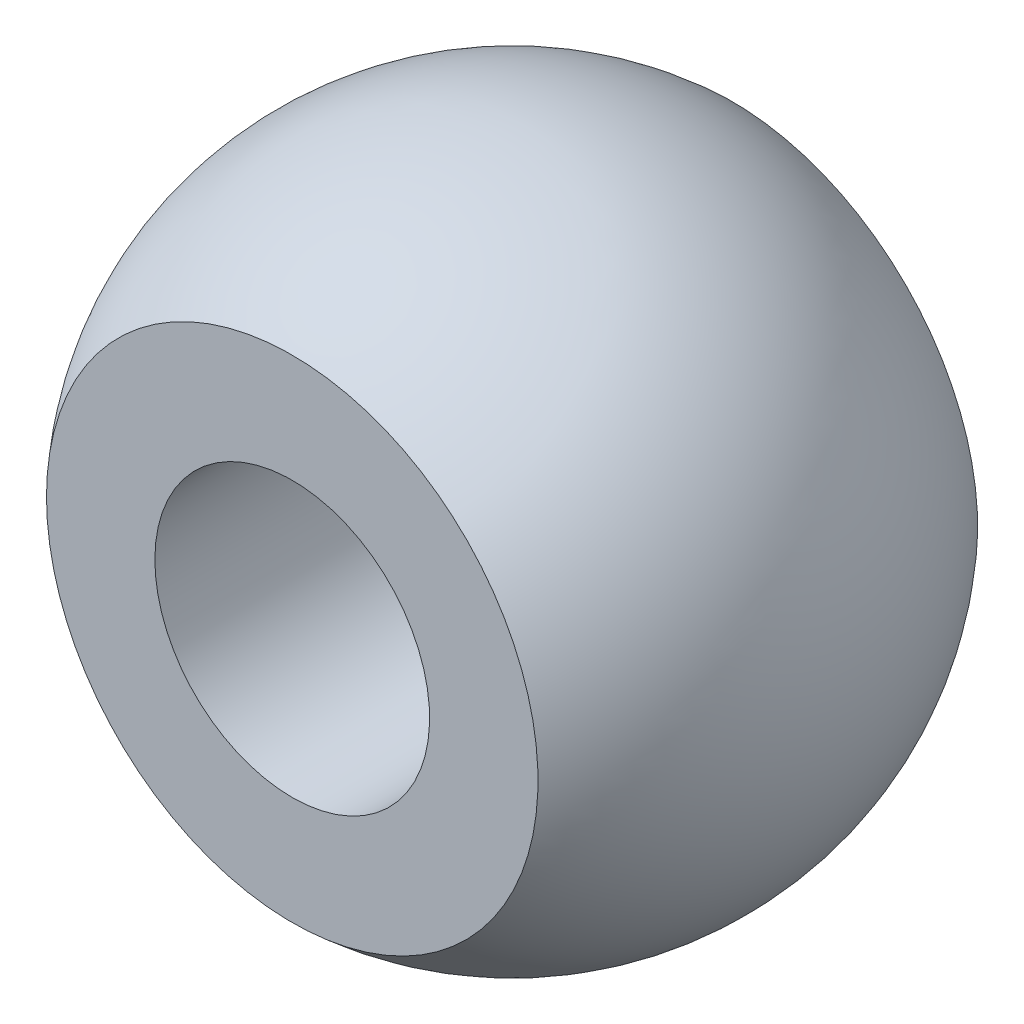
ISO-10303-21;
HEADER;
FILE_DESCRIPTION(('STEP AP214'),'2;1');
FILE_NAME('part.step','',(''),(''),'','','');
FILE_SCHEMA(('AUTOMOTIVE_DESIGN { 1 0 10303 214 1 1 1 1 }'));
ENDSEC;
DATA;
#1=APPLICATION_CONTEXT('core data for automotive mechanical design processes');
#2=APPLICATION_PROTOCOL_DEFINITION('international standard','automotive_design',2000,#1);
#3=PRODUCT_CONTEXT('',#1,'mechanical');
#4=PRODUCT('Part','Part','',(#3));
#5=PRODUCT_RELATED_PRODUCT_CATEGORY('part','',(#4));
#6=PRODUCT_DEFINITION_FORMATION('','',#4);
#7=PRODUCT_DEFINITION_CONTEXT('part definition',#1,'design');
#8=PRODUCT_DEFINITION('design','',#6,#7);
#9=PRODUCT_DEFINITION_SHAPE('','',#8);
#10=(LENGTH_UNIT() NAMED_UNIT(*) SI_UNIT(.MILLI.,.METRE.));
#11=(NAMED_UNIT(*) PLANE_ANGLE_UNIT() SI_UNIT($,.RADIAN.));
#12=(NAMED_UNIT(*) SI_UNIT($,.STERADIAN.) SOLID_ANGLE_UNIT());
#13=UNCERTAINTY_MEASURE_WITH_UNIT(LENGTH_MEASURE(1.E-05),#10,'distance_accuracy_value','');
#14=(GEOMETRIC_REPRESENTATION_CONTEXT(3) GLOBAL_UNCERTAINTY_ASSIGNED_CONTEXT((#13)) GLOBAL_UNIT_ASSIGNED_CONTEXT((#10,
#11,#12)) REPRESENTATION_CONTEXT('',''));
#15=CARTESIAN_POINT('',(0.,0.,0.));
#16=DIRECTION('',(0.,0.,1.));
#17=DIRECTION('',(1.,0.,0.));
#18=AXIS2_PLACEMENT_3D('',#15,#16,#17);
#19=CARTESIAN_POINT('',(0.,0.,-6.));
#20=DIRECTION('',(0.,0.,1.));
#21=DIRECTION('',(1.,0.,0.));
#22=AXIS2_PLACEMENT_3D('',#19,#20,#21);
#23=CYLINDRICAL_SURFACE('',#22,2.5);
#24=CARTESIAN_POINT('',(0.,0.,4.));
#25=DIRECTION('',(0.,0.,-1.));
#26=DIRECTION('',(-1.,0.,0.));
#27=AXIS2_PLACEMENT_3D('',#24,#25,#26);
#28=CIRCLE('',#27,2.5);
#29=CARTESIAN_POINT('',(-2.5,0.,4.));
#30=VERTEX_POINT('',#29);
#31=EDGE_CURVE('E39',#30,#30,#28,.F.);
#32=ORIENTED_EDGE('',*,*,#31,.T.);
#33=EDGE_LOOP('',(#32));
#34=FACE_BOUND('',#33,.T.);
#35=CARTESIAN_POINT('',(0.,0.,-4.));
#36=DIRECTION('',(0.,0.,1.));
#37=DIRECTION('',(0.,-1.,0.));
#38=AXIS2_PLACEMENT_3D('',#35,#36,#37);
#39=CIRCLE('',#38,2.5);
#40=CARTESIAN_POINT('',(0.,-2.5,-4.00000000000002));
#41=VERTEX_POINT('',#40);
#42=EDGE_CURVE('E51',#41,#41,#39,.F.);
#43=ORIENTED_EDGE('',*,*,#42,.T.);
#44=EDGE_LOOP('',(#43));
#45=FACE_BOUND('',#44,.T.);
#46=ADVANCED_FACE('F35',(#34,#45),#23,.F.);
#47=CARTESIAN_POINT('',(-6.,-4.47213595499958,-4.00000000000003));
#48=DIRECTION('',(0.,0.,1.));
#49=DIRECTION('',(0.,-1.,0.));
#50=AXIS2_PLACEMENT_3D('',#47,#48,#49);
#51=PLANE('',#50);
#52=CARTESIAN_POINT('',(0.,0.,-4.));
#53=DIRECTION('',(0.,0.,1.));
#54=DIRECTION('',(0.,-1.,0.));
#55=AXIS2_PLACEMENT_3D('',#52,#53,#54);
#56=CIRCLE('',#55,4.47213595499958);
#57=CARTESIAN_POINT('',(0.,-4.47213595499955,-4.00000000000003));
#58=VERTEX_POINT('',#57);
#59=EDGE_CURVE('E49',#58,#58,#56,.F.);
#60=ORIENTED_EDGE('',*,*,#59,.T.);
#61=EDGE_LOOP('',(#60));
#62=FACE_BOUND('',#61,.T.);
#63=ORIENTED_EDGE('',*,*,#42,.F.);
#64=EDGE_LOOP('',(#63));
#65=FACE_BOUND('',#64,.T.);
#66=ADVANCED_FACE('F60',(#62,#65),#51,.F.);
#67=CARTESIAN_POINT('',(-6.,-4.47213595499958,4.));
#68=DIRECTION('',(0.,0.,-1.));
#69=DIRECTION('',(-1.,0.,0.));
#70=AXIS2_PLACEMENT_3D('',#67,#68,#69);
#71=PLANE('',#70);
#72=CARTESIAN_POINT('',(0.,0.,4.));
#73=DIRECTION('',(0.,0.,-1.));
#74=DIRECTION('',(-1.,0.,0.));
#75=AXIS2_PLACEMENT_3D('',#72,#73,#74);
#76=CIRCLE('',#75,4.47213595499958);
#77=CARTESIAN_POINT('',(-4.47213595499958,0.,4.));
#78=VERTEX_POINT('',#77);
#79=EDGE_CURVE('E10',#78,#78,#76,.F.);
#80=ORIENTED_EDGE('',*,*,#79,.T.);
#81=EDGE_LOOP('',(#80));
#82=FACE_BOUND('',#81,.T.);
#83=ORIENTED_EDGE('',*,*,#31,.F.);
#84=EDGE_LOOP('',(#83));
#85=FACE_BOUND('',#84,.T.);
#86=ADVANCED_FACE('F64',(#82,#85),#71,.F.);
#87=CARTESIAN_POINT('',(0.,0.,0.));
#88=DIRECTION('',(0.,1.,0.));
#89=DIRECTION('',(1.,0.,0.));
#90=AXIS2_PLACEMENT_3D('',#87,#88,#89);
#91=SPHERICAL_SURFACE('',#90,6.);
#92=CARTESIAN_POINT('',(0.,0.,0.));
#93=DIRECTION('',(0.,0.,-1.));
#94=DIRECTION('',(-1.,0.,0.));
#95=AXIS2_PLACEMENT_3D('',#92,#93,#94);
#96=SPHERICAL_SURFACE('',#95,6.);
#97=ORIENTED_EDGE('',*,*,#79,.F.);
#98=EDGE_LOOP('',(#97));
#99=FACE_BOUND('',#98,.T.);
#100=ORIENTED_EDGE('',*,*,#59,.F.);
#101=EDGE_LOOP('',(#100));
#102=FACE_BOUND('',#101,.T.);
#103=ADVANCED_FACE('F37',(#99,#102),#96,.T.);
#104=CLOSED_SHELL('',(#46,#66,#86,#103));
#105=MANIFOLD_SOLID_BREP('B2',#104);
#106=ADVANCED_BREP_SHAPE_REPRESENTATION('',(#18,#105),#14);
#107=SHAPE_DEFINITION_REPRESENTATION(#9,#106);
ENDSEC;
END-ISO-10303-21;
